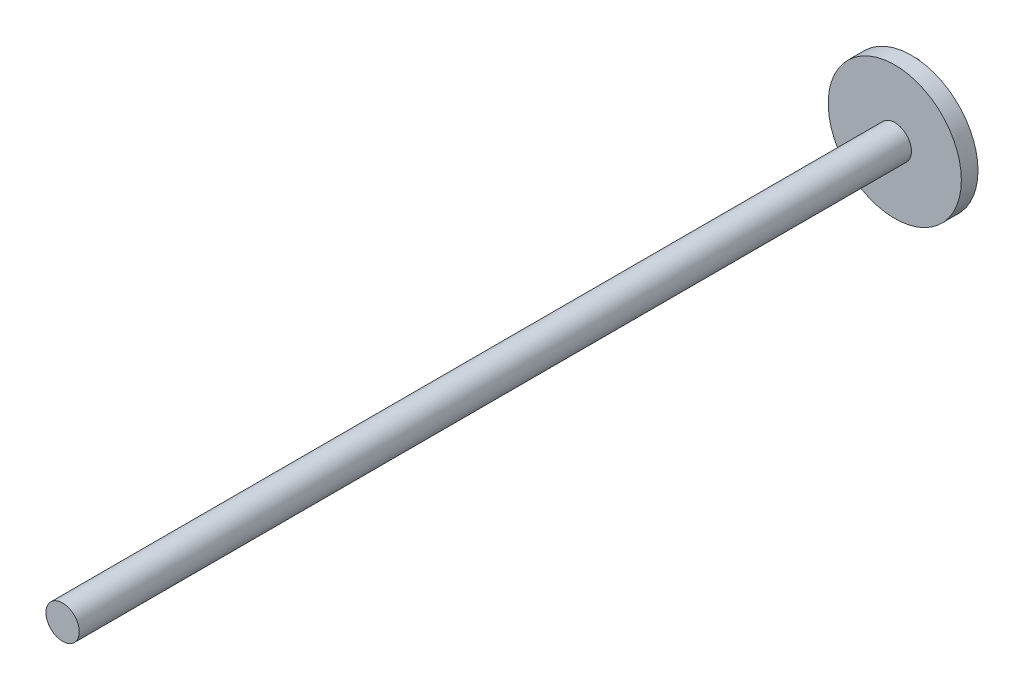
ISO-10303-21;
HEADER;
FILE_DESCRIPTION(('STEP AP214'),'2;1');
FILE_NAME('part.step','',(''),(''),'','','');
FILE_SCHEMA(('AUTOMOTIVE_DESIGN { 1 0 10303 214 1 1 1 1 }'));
ENDSEC;
DATA;
#1=APPLICATION_CONTEXT('core data for automotive mechanical design processes');
#2=APPLICATION_PROTOCOL_DEFINITION('international standard','automotive_design',2000,#1);
#3=PRODUCT_CONTEXT('',#1,'mechanical');
#4=PRODUCT('Part','Part','',(#3));
#5=PRODUCT_RELATED_PRODUCT_CATEGORY('part','',(#4));
#6=PRODUCT_DEFINITION_FORMATION('','',#4);
#7=PRODUCT_DEFINITION_CONTEXT('part definition',#1,'design');
#8=PRODUCT_DEFINITION('design','',#6,#7);
#9=PRODUCT_DEFINITION_SHAPE('','',#8);
#10=(LENGTH_UNIT() NAMED_UNIT(*) SI_UNIT(.MILLI.,.METRE.));
#11=(NAMED_UNIT(*) PLANE_ANGLE_UNIT() SI_UNIT($,.RADIAN.));
#12=(NAMED_UNIT(*) SI_UNIT($,.STERADIAN.) SOLID_ANGLE_UNIT());
#13=UNCERTAINTY_MEASURE_WITH_UNIT(LENGTH_MEASURE(1.E-05),#10,'distance_accuracy_value','');
#14=(GEOMETRIC_REPRESENTATION_CONTEXT(3) GLOBAL_UNCERTAINTY_ASSIGNED_CONTEXT((#13)) GLOBAL_UNIT_ASSIGNED_CONTEXT((#10,
#11,#12)) REPRESENTATION_CONTEXT('',''));
#15=CARTESIAN_POINT('',(0.,0.,0.));
#16=DIRECTION('',(0.,0.,1.));
#17=DIRECTION('',(1.,0.,0.));
#18=AXIS2_PLACEMENT_3D('',#15,#16,#17);
#19=CARTESIAN_POINT('',(0.,0.,10.));
#20=DIRECTION('',(0.,0.,-1.));
#21=DIRECTION('',(-1.,0.,0.));
#22=AXIS2_PLACEMENT_3D('',#19,#20,#21);
#23=CYLINDRICAL_SURFACE('',#22,40.);
#24=CARTESIAN_POINT('',(0.,0.,10.));
#25=DIRECTION('',(0.,0.,1.));
#26=DIRECTION('',(1.,0.,0.));
#27=AXIS2_PLACEMENT_3D('',#24,#25,#26);
#28=CIRCLE('',#27,40.);
#29=CARTESIAN_POINT('',(40.,0.,10.));
#30=VERTEX_POINT('',#29);
#31=EDGE_CURVE('E59',#30,#30,#28,.T.);
#32=ORIENTED_EDGE('',*,*,#31,.F.);
#33=EDGE_LOOP('',(#32));
#34=FACE_BOUND('',#33,.T.);
#35=CARTESIAN_POINT('',(0.,0.,0.));
#36=DIRECTION('',(0.,0.,1.));
#37=DIRECTION('',(1.,0.,0.));
#38=AXIS2_PLACEMENT_3D('',#35,#36,#37);
#39=CIRCLE('',#38,40.);
#40=CARTESIAN_POINT('',(40.,0.,0.));
#41=VERTEX_POINT('',#40);
#42=EDGE_CURVE('E65',#41,#41,#39,.T.);
#43=ORIENTED_EDGE('',*,*,#42,.T.);
#44=EDGE_LOOP('',(#43));
#45=FACE_BOUND('',#44,.T.);
#46=ADVANCED_FACE('F47',(#34,#45),#23,.T.);
#47=CARTESIAN_POINT('',(0.,0.,10.));
#48=DIRECTION('',(0.,0.,1.));
#49=DIRECTION('',(1.,0.,0.));
#50=AXIS2_PLACEMENT_3D('',#47,#48,#49);
#51=PLANE('',#50);
#52=CARTESIAN_POINT('',(0.,0.,10.));
#53=DIRECTION('',(0.,0.,1.));
#54=DIRECTION('',(1.,0.,0.));
#55=AXIS2_PLACEMENT_3D('',#52,#53,#54);
#56=CIRCLE('',#55,10.);
#57=CARTESIAN_POINT('',(10.,0.,10.));
#58=VERTEX_POINT('',#57);
#59=EDGE_CURVE('E54',#58,#58,#56,.T.);
#60=ORIENTED_EDGE('',*,*,#59,.F.);
#61=EDGE_LOOP('',(#60));
#62=FACE_BOUND('',#61,.T.);
#63=ORIENTED_EDGE('',*,*,#31,.T.);
#64=EDGE_LOOP('',(#63));
#65=FACE_BOUND('',#64,.T.);
#66=ADVANCED_FACE('F97',(#62,#65),#51,.T.);
#67=CARTESIAN_POINT('',(0.,0.,0.));
#68=DIRECTION('',(0.,0.,1.));
#69=DIRECTION('',(1.,0.,0.));
#70=AXIS2_PLACEMENT_3D('',#67,#68,#69);
#71=PLANE('',#70);
#72=CARTESIAN_POINT('',(-26.9985619159408,0.,0.));
#73=DIRECTION('',(0.,0.,1.));
#74=DIRECTION('',(1.,0.,0.));
#75=AXIS2_PLACEMENT_3D('',#72,#73,#74);
#76=CIRCLE('',#75,10.);
#77=CARTESIAN_POINT('',(-16.9985619159408,0.,0.));
#78=VERTEX_POINT('',#77);
#79=EDGE_CURVE('E10',#78,#78,#76,.F.);
#80=ORIENTED_EDGE('',*,*,#79,.F.);
#81=EDGE_LOOP('',(#80));
#82=FACE_BOUND('',#81,.T.);
#83=ORIENTED_EDGE('',*,*,#42,.F.);
#84=EDGE_LOOP('',(#83));
#85=FACE_BOUND('',#84,.T.);
#86=ADVANCED_FACE('F102',(#82,#85),#71,.F.);
#87=CARTESIAN_POINT('',(0.,0.,510.));
#88=DIRECTION('',(0.,0.,-1.));
#89=DIRECTION('',(-1.,0.,0.));
#90=AXIS2_PLACEMENT_3D('',#87,#88,#89);
#91=CYLINDRICAL_SURFACE('',#90,10.);
#92=CARTESIAN_POINT('',(0.,0.,510.));
#93=DIRECTION('',(0.,0.,1.));
#94=DIRECTION('',(1.,0.,0.));
#95=AXIS2_PLACEMENT_3D('',#92,#93,#94);
#96=CIRCLE('',#95,10.);
#97=CARTESIAN_POINT('',(10.,0.,510.));
#98=VERTEX_POINT('',#97);
#99=EDGE_CURVE('E68',#98,#98,#96,.T.);
#100=ORIENTED_EDGE('',*,*,#99,.F.);
#101=EDGE_LOOP('',(#100));
#102=FACE_BOUND('',#101,.T.);
#103=ORIENTED_EDGE('',*,*,#59,.T.);
#104=EDGE_LOOP('',(#103));
#105=FACE_BOUND('',#104,.T.);
#106=ADVANCED_FACE('F94',(#102,#105),#91,.T.);
#107=CARTESIAN_POINT('',(0.,0.,510.));
#108=DIRECTION('',(0.,0.,1.));
#109=DIRECTION('',(1.,0.,0.));
#110=AXIS2_PLACEMENT_3D('',#107,#108,#109);
#111=PLANE('',#110);
#112=ORIENTED_EDGE('',*,*,#99,.T.);
#113=EDGE_LOOP('',(#112));
#114=FACE_BOUND('',#113,.T.);
#115=ADVANCED_FACE('F87',(#114),#111,.T.);
#116=CARTESIAN_POINT('',(-26.9985619159408,0.,-30.));
#117=DIRECTION('',(0.,0.,1.));
#118=DIRECTION('',(1.,0.,0.));
#119=AXIS2_PLACEMENT_3D('',#116,#117,#118);
#120=CYLINDRICAL_SURFACE('',#119,10.);
#121=CARTESIAN_POINT('',(-26.9985619159408,0.,-30.));
#122=DIRECTION('',(0.,0.,-1.));
#123=DIRECTION('',(-1.,0.,0.));
#124=AXIS2_PLACEMENT_3D('',#121,#122,#123);
#125=CIRCLE('',#124,10.);
#126=CARTESIAN_POINT('',(-36.9985619159408,0.,-30.));
#127=VERTEX_POINT('',#126);
#128=EDGE_CURVE('E76',#127,#127,#125,.T.);
#129=ORIENTED_EDGE('',*,*,#128,.F.);
#130=EDGE_LOOP('',(#129));
#131=FACE_BOUND('',#130,.T.);
#132=ORIENTED_EDGE('',*,*,#79,.T.);
#133=EDGE_LOOP('',(#132));
#134=FACE_BOUND('',#133,.T.);
#135=ADVANCED_FACE('F85',(#131,#134),#120,.T.);
#136=CARTESIAN_POINT('',(-26.9985619159408,0.,-30.));
#137=DIRECTION('',(0.,0.,-1.));
#138=DIRECTION('',(-1.,0.,0.));
#139=AXIS2_PLACEMENT_3D('',#136,#137,#138);
#140=PLANE('',#139);
#141=ORIENTED_EDGE('',*,*,#128,.T.);
#142=EDGE_LOOP('',(#141));
#143=FACE_BOUND('',#142,.T.);
#144=ADVANCED_FACE('F83',(#143),#140,.T.);
#145=CLOSED_SHELL('',(#46,#66,#86,#106,#115,#135,#144));
#146=MANIFOLD_SOLID_BREP('B2',#145);
#147=ADVANCED_BREP_SHAPE_REPRESENTATION('',(#18,#146),#14);
#148=SHAPE_DEFINITION_REPRESENTATION(#9,#147);
ENDSEC;
END-ISO-10303-21;
